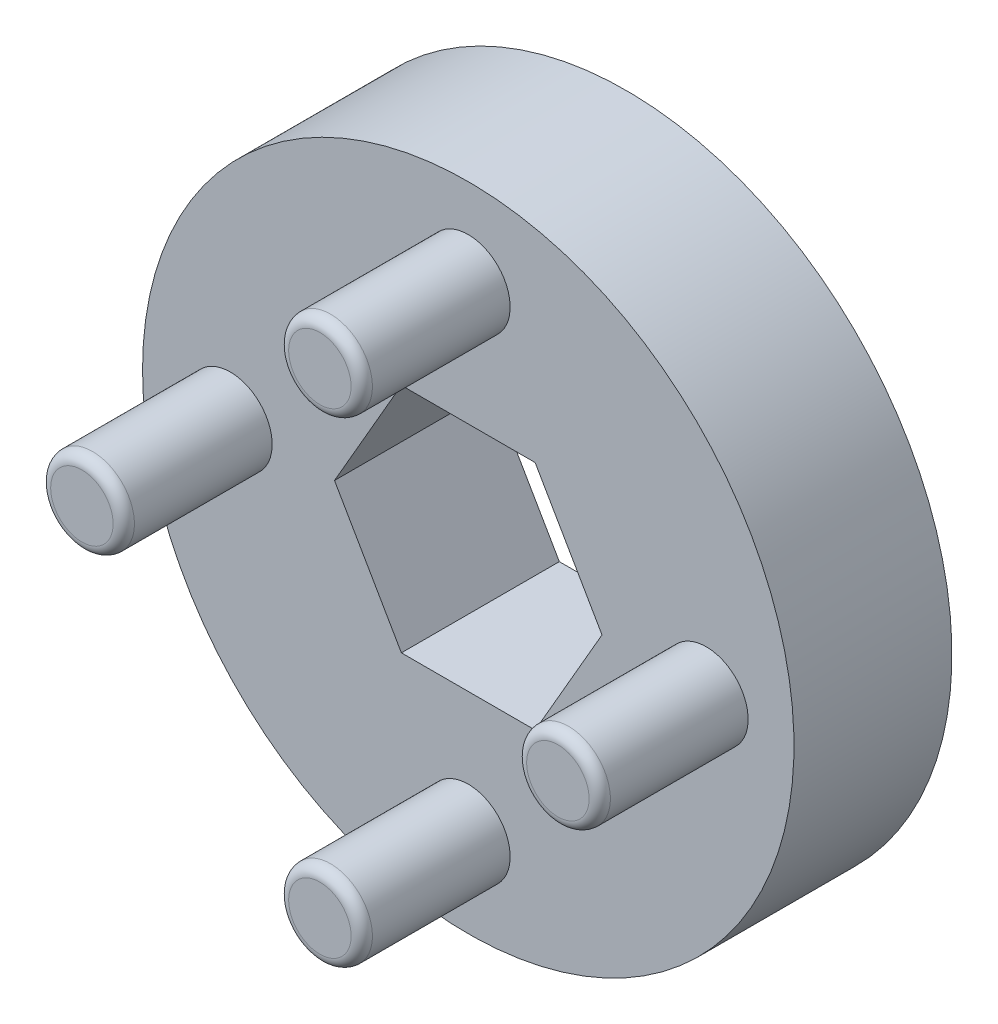
ISO-10303-21;
HEADER;
FILE_DESCRIPTION(('STEP AP214'),'2;1');
FILE_NAME('part.step','',(''),(''),'','','');
FILE_SCHEMA(('AUTOMOTIVE_DESIGN { 1 0 10303 214 1 1 1 1 }'));
ENDSEC;
DATA;
#1=APPLICATION_CONTEXT('core data for automotive mechanical design processes');
#2=APPLICATION_PROTOCOL_DEFINITION('international standard','automotive_design',2000,#1);
#3=PRODUCT_CONTEXT('',#1,'mechanical');
#4=PRODUCT('Part','Part','',(#3));
#5=PRODUCT_RELATED_PRODUCT_CATEGORY('part','',(#4));
#6=PRODUCT_DEFINITION_FORMATION('','',#4);
#7=PRODUCT_DEFINITION_CONTEXT('part definition',#1,'design');
#8=PRODUCT_DEFINITION('design','',#6,#7);
#9=PRODUCT_DEFINITION_SHAPE('','',#8);
#10=(LENGTH_UNIT() NAMED_UNIT(*) SI_UNIT(.MILLI.,.METRE.));
#11=(NAMED_UNIT(*) PLANE_ANGLE_UNIT() SI_UNIT($,.RADIAN.));
#12=(NAMED_UNIT(*) SI_UNIT($,.STERADIAN.) SOLID_ANGLE_UNIT());
#13=UNCERTAINTY_MEASURE_WITH_UNIT(LENGTH_MEASURE(1.E-05),#10,'distance_accuracy_value','');
#14=(GEOMETRIC_REPRESENTATION_CONTEXT(3) GLOBAL_UNCERTAINTY_ASSIGNED_CONTEXT((#13)) GLOBAL_UNIT_ASSIGNED_CONTEXT((#10,
#11,#12)) REPRESENTATION_CONTEXT('',''));
#15=CARTESIAN_POINT('',(0.,0.,0.));
#16=DIRECTION('',(0.,0.,1.));
#17=DIRECTION('',(1.,0.,0.));
#18=AXIS2_PLACEMENT_3D('',#15,#16,#17);
#19=CARTESIAN_POINT('',(-11.3665,1.19057767913881E-13,14.6304));
#20=DIRECTION('',(0.,0.,1.));
#21=DIRECTION('',(1.,0.,0.));
#22=AXIS2_PLACEMENT_3D('',#19,#20,#21);
#23=PLANE('',#22);
#24=CARTESIAN_POINT('',(-11.3665,1.19057767913881E-13,14.6304));
#25=DIRECTION('',(0.,0.,-1.));
#26=DIRECTION('',(-1.,0.,0.));
#27=AXIS2_PLACEMENT_3D('',#24,#25,#26);
#28=CIRCLE('',#27,1.49225);
#29=CARTESIAN_POINT('',(-12.85875,1.19252958243964E-13,14.6304));
#30=VERTEX_POINT('',#29);
#31=CARTESIAN_POINT('',(-9.87425,1.19057767913881E-13,14.6304));
#32=VERTEX_POINT('',#31);
#33=EDGE_CURVE('E92',#30,#32,#28,.T.);
#34=ORIENTED_EDGE('',*,*,#33,.F.);
#35=CARTESIAN_POINT('',(-11.3665,1.19057767913881E-13,14.6304));
#36=DIRECTION('',(0.,0.,-1.));
#37=DIRECTION('',(1.,0.,0.));
#38=AXIS2_PLACEMENT_3D('',#35,#36,#37);
#39=CIRCLE('',#38,1.49225);
#40=EDGE_CURVE('E90',#32,#30,#39,.T.);
#41=ORIENTED_EDGE('',*,*,#40,.F.);
#42=EDGE_LOOP('',(#34,#41));
#43=FACE_BOUND('',#42,.T.);
#44=ADVANCED_FACE('F14',(#43),#23,.T.);
#45=CARTESIAN_POINT('',(0.,-11.3665,14.6304));
#46=DIRECTION('',(0.,0.,1.));
#47=DIRECTION('',(1.,0.,0.));
#48=AXIS2_PLACEMENT_3D('',#45,#46,#47);
#49=PLANE('',#48);
#50=CARTESIAN_POINT('',(0.,-11.3665,14.6304));
#51=DIRECTION('',(0.,0.,-1.));
#52=DIRECTION('',(-1.,0.,0.));
#53=AXIS2_PLACEMENT_3D('',#50,#51,#52);
#54=CIRCLE('',#53,1.49225);
#55=CARTESIAN_POINT('',(-1.49225,-11.3665,14.6304));
#56=VERTEX_POINT('',#55);
#57=CARTESIAN_POINT('',(1.49225,-11.3665,14.6304));
#58=VERTEX_POINT('',#57);
#59=EDGE_CURVE('E327',#56,#58,#54,.T.);
#60=ORIENTED_EDGE('',*,*,#59,.F.);
#61=CARTESIAN_POINT('',(0.,-11.3665,14.6304));
#62=DIRECTION('',(0.,0.,-1.));
#63=DIRECTION('',(1.,0.,0.));
#64=AXIS2_PLACEMENT_3D('',#61,#62,#63);
#65=CIRCLE('',#64,1.49225);
#66=EDGE_CURVE('E98',#58,#56,#65,.T.);
#67=ORIENTED_EDGE('',*,*,#66,.F.);
#68=EDGE_LOOP('',(#60,#67));
#69=FACE_BOUND('',#68,.T.);
#70=ADVANCED_FACE('F331',(#69),#49,.T.);
#71=CARTESIAN_POINT('',(11.3665,0.,14.6304));
#72=DIRECTION('',(0.,0.,1.));
#73=DIRECTION('',(1.,0.,0.));
#74=AXIS2_PLACEMENT_3D('',#71,#72,#73);
#75=PLANE('',#74);
#76=CARTESIAN_POINT('',(11.3665,0.,14.6304));
#77=DIRECTION('',(0.,0.,-1.));
#78=DIRECTION('',(-1.,0.,0.));
#79=AXIS2_PLACEMENT_3D('',#76,#77,#78);
#80=CIRCLE('',#79,1.49225);
#81=CARTESIAN_POINT('',(9.87425,0.,14.6304));
#82=VERTEX_POINT('',#81);
#83=CARTESIAN_POINT('',(12.85875,0.,14.6304));
#84=VERTEX_POINT('',#83);
#85=EDGE_CURVE('E518',#82,#84,#80,.T.);
#86=ORIENTED_EDGE('',*,*,#85,.F.);
#87=CARTESIAN_POINT('',(11.3665,0.,14.6304));
#88=DIRECTION('',(0.,0.,-1.));
#89=DIRECTION('',(1.,0.,0.));
#90=AXIS2_PLACEMENT_3D('',#87,#88,#89);
#91=CIRCLE('',#90,1.49225);
#92=EDGE_CURVE('E308',#84,#82,#91,.T.);
#93=ORIENTED_EDGE('',*,*,#92,.F.);
#94=EDGE_LOOP('',(#86,#93));
#95=FACE_BOUND('',#94,.T.);
#96=ADVANCED_FACE('F168',(#95),#75,.T.);
#97=CARTESIAN_POINT('',(0.,11.3665,14.6304));
#98=DIRECTION('',(0.,0.,1.));
#99=DIRECTION('',(1.,0.,0.));
#100=AXIS2_PLACEMENT_3D('',#97,#98,#99);
#101=PLANE('',#100);
#102=CARTESIAN_POINT('',(0.,11.3665,14.6304));
#103=DIRECTION('',(0.,0.,-1.));
#104=DIRECTION('',(-1.,0.,0.));
#105=AXIS2_PLACEMENT_3D('',#102,#103,#104);
#106=CIRCLE('',#105,1.49225);
#107=CARTESIAN_POINT('',(-1.49225,11.3665,14.6304));
#108=VERTEX_POINT('',#107);
#109=CARTESIAN_POINT('',(1.49225,11.3665,14.6304));
#110=VERTEX_POINT('',#109);
#111=EDGE_CURVE('E148',#108,#110,#106,.T.);
#112=ORIENTED_EDGE('',*,*,#111,.F.);
#113=CARTESIAN_POINT('',(0.,11.3665,14.6304));
#114=DIRECTION('',(0.,0.,-1.));
#115=DIRECTION('',(1.,0.,0.));
#116=AXIS2_PLACEMENT_3D('',#113,#114,#115);
#117=CIRCLE('',#116,1.49225);
#118=EDGE_CURVE('E296',#110,#108,#117,.T.);
#119=ORIENTED_EDGE('',*,*,#118,.F.);
#120=EDGE_LOOP('',(#112,#119));
#121=FACE_BOUND('',#120,.T.);
#122=ADVANCED_FACE('F159',(#121),#101,.T.);
#123=CARTESIAN_POINT('',(-11.3665,1.19057767913881E-13,14.1224));
#124=DIRECTION('',(0.,0.,1.));
#125=DIRECTION('',(1.,0.,0.));
#126=AXIS2_PLACEMENT_3D('',#123,#124,#125);
#127=TOROIDAL_SURFACE('',#126,1.49225,0.508);
#128=ORIENTED_EDGE('',*,*,#40,.T.);
#129=ORIENTED_EDGE('',*,*,#33,.T.);
#130=EDGE_LOOP('',(#128,#129));
#131=FACE_BOUND('',#130,.T.);
#132=CARTESIAN_POINT('',(-11.3665,1.19057767913881E-13,14.1224));
#133=DIRECTION('',(0.,0.,-1.));
#134=DIRECTION('',(-1.,0.,0.));
#135=AXIS2_PLACEMENT_3D('',#132,#133,#134);
#136=CIRCLE('',#135,2.00025);
#137=CARTESIAN_POINT('',(-13.36675,1.19057767913881E-13,14.1224));
#138=VERTEX_POINT('',#137);
#139=EDGE_CURVE('E146',#138,#138,#136,.T.);
#140=ORIENTED_EDGE('',*,*,#139,.F.);
#141=EDGE_LOOP('',(#140));
#142=FACE_BOUND('',#141,.T.);
#143=ADVANCED_FACE('F94',(#131,#142),#127,.T.);
#144=CARTESIAN_POINT('',(0.,-11.3665,14.1224));
#145=DIRECTION('',(0.,0.,1.));
#146=DIRECTION('',(1.,0.,0.));
#147=AXIS2_PLACEMENT_3D('',#144,#145,#146);
#148=TOROIDAL_SURFACE('',#147,1.49225,0.508);
#149=ORIENTED_EDGE('',*,*,#66,.T.);
#150=ORIENTED_EDGE('',*,*,#59,.T.);
#151=EDGE_LOOP('',(#149,#150));
#152=FACE_BOUND('',#151,.T.);
#153=CARTESIAN_POINT('',(0.,-11.3665,14.1224));
#154=DIRECTION('',(0.,0.,-1.));
#155=DIRECTION('',(-1.,0.,0.));
#156=AXIS2_PLACEMENT_3D('',#153,#154,#155);
#157=CIRCLE('',#156,2.00025);
#158=CARTESIAN_POINT('',(-2.00025,-11.3665,14.1224));
#159=VERTEX_POINT('',#158);
#160=EDGE_CURVE('E145',#159,#159,#157,.T.);
#161=ORIENTED_EDGE('',*,*,#160,.F.);
#162=EDGE_LOOP('',(#161));
#163=FACE_BOUND('',#162,.T.);
#164=ADVANCED_FACE('F123',(#152,#163),#148,.T.);
#165=CARTESIAN_POINT('',(11.3665,0.,14.1224));
#166=DIRECTION('',(0.,0.,1.));
#167=DIRECTION('',(1.,0.,0.));
#168=AXIS2_PLACEMENT_3D('',#165,#166,#167);
#169=TOROIDAL_SURFACE('',#168,1.49225,0.508);
#170=ORIENTED_EDGE('',*,*,#92,.T.);
#171=ORIENTED_EDGE('',*,*,#85,.T.);
#172=EDGE_LOOP('',(#170,#171));
#173=FACE_BOUND('',#172,.T.);
#174=CARTESIAN_POINT('',(11.3665,0.,14.1224));
#175=DIRECTION('',(0.,0.,-1.));
#176=DIRECTION('',(-1.,0.,0.));
#177=AXIS2_PLACEMENT_3D('',#174,#175,#176);
#178=CIRCLE('',#177,2.00025);
#179=CARTESIAN_POINT('',(9.36625,0.,14.1224));
#180=VERTEX_POINT('',#179);
#181=EDGE_CURVE('E204',#180,#180,#178,.T.);
#182=ORIENTED_EDGE('',*,*,#181,.F.);
#183=EDGE_LOOP('',(#182));
#184=FACE_BOUND('',#183,.T.);
#185=ADVANCED_FACE('F133',(#173,#184),#169,.T.);
#186=CARTESIAN_POINT('',(0.,11.3665,14.1224));
#187=DIRECTION('',(0.,0.,1.));
#188=DIRECTION('',(1.,0.,0.));
#189=AXIS2_PLACEMENT_3D('',#186,#187,#188);
#190=TOROIDAL_SURFACE('',#189,1.49225,0.508);
#191=ORIENTED_EDGE('',*,*,#118,.T.);
#192=ORIENTED_EDGE('',*,*,#111,.T.);
#193=EDGE_LOOP('',(#191,#192));
#194=FACE_BOUND('',#193,.T.);
#195=CARTESIAN_POINT('',(0.,11.3665,14.1224));
#196=DIRECTION('',(0.,0.,-1.));
#197=DIRECTION('',(-1.,0.,0.));
#198=AXIS2_PLACEMENT_3D('',#195,#196,#197);
#199=CIRCLE('',#198,2.00025);
#200=CARTESIAN_POINT('',(-2.00025,11.3665,14.1224));
#201=VERTEX_POINT('',#200);
#202=EDGE_CURVE('E202',#201,#201,#199,.T.);
#203=ORIENTED_EDGE('',*,*,#202,.F.);
#204=EDGE_LOOP('',(#203));
#205=FACE_BOUND('',#204,.T.);
#206=ADVANCED_FACE('F186',(#194,#205),#190,.T.);
#207=CARTESIAN_POINT('',(-11.3665,1.19057767913881E-13,14.6304));
#208=DIRECTION('',(0.,0.,-1.));
#209=DIRECTION('',(-1.,0.,0.));
#210=AXIS2_PLACEMENT_3D('',#207,#208,#209);
#211=CYLINDRICAL_SURFACE('',#210,2.00025);
#212=CARTESIAN_POINT('',(-11.3665,1.19057767913881E-13,7.5438));
#213=DIRECTION('',(0.,0.,-1.));
#214=DIRECTION('',(-1.,0.,0.));
#215=AXIS2_PLACEMENT_3D('',#212,#213,#214);
#216=CIRCLE('',#215,2.00025);
#217=CARTESIAN_POINT('',(-13.36675,1.19057767913881E-13,7.5438));
#218=VERTEX_POINT('',#217);
#219=EDGE_CURVE('E210',#218,#218,#216,.T.);
#220=ORIENTED_EDGE('',*,*,#219,.F.);
#221=EDGE_LOOP('',(#220));
#222=FACE_BOUND('',#221,.T.);
#223=ORIENTED_EDGE('',*,*,#139,.T.);
#224=EDGE_LOOP('',(#223));
#225=FACE_BOUND('',#224,.T.);
#226=ADVANCED_FACE('F196',(#222,#225),#211,.T.);
#227=CARTESIAN_POINT('',(0.,-11.3665,14.6304));
#228=DIRECTION('',(0.,0.,-1.));
#229=DIRECTION('',(-1.,0.,0.));
#230=AXIS2_PLACEMENT_3D('',#227,#228,#229);
#231=CYLINDRICAL_SURFACE('',#230,2.00025);
#232=CARTESIAN_POINT('',(0.,-11.3665,7.5438));
#233=DIRECTION('',(0.,0.,-1.));
#234=DIRECTION('',(-1.,0.,0.));
#235=AXIS2_PLACEMENT_3D('',#232,#233,#234);
#236=CIRCLE('',#235,2.00025);
#237=CARTESIAN_POINT('',(-2.00025,-11.3665,7.5438));
#238=VERTEX_POINT('',#237);
#239=EDGE_CURVE('E287',#238,#238,#236,.T.);
#240=ORIENTED_EDGE('',*,*,#239,.F.);
#241=EDGE_LOOP('',(#240));
#242=FACE_BOUND('',#241,.T.);
#243=ORIENTED_EDGE('',*,*,#160,.T.);
#244=EDGE_LOOP('',(#243));
#245=FACE_BOUND('',#244,.T.);
#246=ADVANCED_FACE('F214',(#242,#245),#231,.T.);
#247=CARTESIAN_POINT('',(11.3665,0.,14.6304));
#248=DIRECTION('',(0.,0.,-1.));
#249=DIRECTION('',(-1.,0.,0.));
#250=AXIS2_PLACEMENT_3D('',#247,#248,#249);
#251=CYLINDRICAL_SURFACE('',#250,2.00025);
#252=CARTESIAN_POINT('',(11.3665,0.,7.5438));
#253=DIRECTION('',(0.,0.,-1.));
#254=DIRECTION('',(-1.,0.,0.));
#255=AXIS2_PLACEMENT_3D('',#252,#253,#254);
#256=CIRCLE('',#255,2.00025);
#257=CARTESIAN_POINT('',(9.36625,0.,7.5438));
#258=VERTEX_POINT('',#257);
#259=EDGE_CURVE('E281',#258,#258,#256,.T.);
#260=ORIENTED_EDGE('',*,*,#259,.F.);
#261=EDGE_LOOP('',(#260));
#262=FACE_BOUND('',#261,.T.);
#263=ORIENTED_EDGE('',*,*,#181,.T.);
#264=EDGE_LOOP('',(#263));
#265=FACE_BOUND('',#264,.T.);
#266=ADVANCED_FACE('F217',(#262,#265),#251,.T.);
#267=CARTESIAN_POINT('',(0.,11.3665,14.6304));
#268=DIRECTION('',(0.,0.,-1.));
#269=DIRECTION('',(-1.,0.,0.));
#270=AXIS2_PLACEMENT_3D('',#267,#268,#269);
#271=CYLINDRICAL_SURFACE('',#270,2.00025);
#272=CARTESIAN_POINT('',(0.,11.3665,7.5438));
#273=DIRECTION('',(0.,0.,-1.));
#274=DIRECTION('',(-1.,0.,0.));
#275=AXIS2_PLACEMENT_3D('',#272,#273,#274);
#276=CIRCLE('',#275,2.00025);
#277=CARTESIAN_POINT('',(-2.00025,11.3665,7.5438));
#278=VERTEX_POINT('',#277);
#279=EDGE_CURVE('E276',#278,#278,#276,.T.);
#280=ORIENTED_EDGE('',*,*,#279,.F.);
#281=EDGE_LOOP('',(#280));
#282=FACE_BOUND('',#281,.T.);
#283=ORIENTED_EDGE('',*,*,#202,.T.);
#284=EDGE_LOOP('',(#283));
#285=FACE_BOUND('',#284,.T.);
#286=ADVANCED_FACE('F224',(#282,#285),#271,.T.);
#287=CARTESIAN_POINT('',(0.,0.,7.5438));
#288=DIRECTION('',(0.,0.,1.));
#289=DIRECTION('',(1.,0.,0.));
#290=AXIS2_PLACEMENT_3D('',#287,#288,#289);
#291=PLANE('',#290);
#292=DIRECTION('',(0.5,0.866025403784439,0.));
#293=VECTOR('',#292,1.);
#294=CARTESIAN_POINT('',(-3.19405,5.53225688191537,7.5438));
#295=LINE('',#294,#293);
#296=CARTESIAN_POINT('',(-3.19405,5.53225688191537,7.5438));
#297=VERTEX_POINT('',#296);
#298=CARTESIAN_POINT('',(-6.3881,0.,7.5438));
#299=VERTEX_POINT('',#298);
#300=EDGE_CURVE('E578',#297,#299,#295,.F.);
#301=ORIENTED_EDGE('',*,*,#300,.F.);
#302=DIRECTION('',(1.,0.,0.));
#303=VECTOR('',#302,1.);
#304=CARTESIAN_POINT('',(3.19405,5.53225688191537,7.5438));
#305=LINE('',#304,#303);
#306=CARTESIAN_POINT('',(3.19405,5.53225688191537,7.5438));
#307=VERTEX_POINT('',#306);
#308=EDGE_CURVE('E574',#307,#297,#305,.F.);
#309=ORIENTED_EDGE('',*,*,#308,.F.);
#310=DIRECTION('',(0.5,-0.866025403784439,0.));
#311=VECTOR('',#310,1.);
#312=CARTESIAN_POINT('',(6.3881,0.,7.5438));
#313=LINE('',#312,#311);
#314=CARTESIAN_POINT('',(6.3881,0.,7.5438));
#315=VERTEX_POINT('',#314);
#316=EDGE_CURVE('E570',#315,#307,#313,.F.);
#317=ORIENTED_EDGE('',*,*,#316,.F.);
#318=DIRECTION('',(-0.499999999999999,-0.866025403784439,0.));
#319=VECTOR('',#318,1.);
#320=CARTESIAN_POINT('',(3.19405,-5.53225688191537,7.5438));
#321=LINE('',#320,#319);
#322=CARTESIAN_POINT('',(3.19405,-5.53225688191537,7.5438));
#323=VERTEX_POINT('',#322);
#324=EDGE_CURVE('E560',#323,#315,#321,.F.);
#325=ORIENTED_EDGE('',*,*,#324,.F.);
#326=DIRECTION('',(1.,0.,0.));
#327=VECTOR('',#326,1.);
#328=CARTESIAN_POINT('',(-3.19405,-5.53225688191537,7.5438));
#329=LINE('',#328,#327);
#330=CARTESIAN_POINT('',(-3.19405,-5.53225688191537,7.5438));
#331=VERTEX_POINT('',#330);
#332=EDGE_CURVE('E284',#331,#323,#329,.T.);
#333=ORIENTED_EDGE('',*,*,#332,.F.);
#334=DIRECTION('',(-0.5,0.866025403784438,0.));
#335=VECTOR('',#334,1.);
#336=CARTESIAN_POINT('',(-6.3881,0.,7.5438));
#337=LINE('',#336,#335);
#338=EDGE_CURVE('E582',#299,#331,#337,.F.);
#339=ORIENTED_EDGE('',*,*,#338,.F.);
#340=EDGE_LOOP('',(#301,#309,#317,#325,#333,#339));
#341=FACE_BOUND('',#340,.T.);
#342=CARTESIAN_POINT('',(0.,0.,7.5438));
#343=DIRECTION('',(0.,0.,-1.));
#344=DIRECTION('',(-1.,0.,0.));
#345=AXIS2_PLACEMENT_3D('',#342,#343,#344);
#346=CIRCLE('',#345,15.5575);
#347=CARTESIAN_POINT('',(-15.5575,0.,7.5438));
#348=VERTEX_POINT('',#347);
#349=EDGE_CURVE('E280',#348,#348,#346,.T.);
#350=ORIENTED_EDGE('',*,*,#349,.F.);
#351=EDGE_LOOP('',(#350));
#352=FACE_BOUND('',#351,.T.);
#353=ORIENTED_EDGE('',*,*,#279,.T.);
#354=EDGE_LOOP('',(#353));
#355=FACE_BOUND('',#354,.T.);
#356=ORIENTED_EDGE('',*,*,#259,.T.);
#357=EDGE_LOOP('',(#356));
#358=FACE_BOUND('',#357,.T.);
#359=ORIENTED_EDGE('',*,*,#239,.T.);
#360=EDGE_LOOP('',(#359));
#361=FACE_BOUND('',#360,.T.);
#362=ORIENTED_EDGE('',*,*,#219,.T.);
#363=EDGE_LOOP('',(#362));
#364=FACE_BOUND('',#363,.T.);
#365=ADVANCED_FACE('F264',(#341,#352,#355,#358,#361,#364),#291,.T.);
#366=CARTESIAN_POINT('',(0.,0.,7.5438));
#367=DIRECTION('',(0.,0.,-1.));
#368=DIRECTION('',(-1.,0.,0.));
#369=AXIS2_PLACEMENT_3D('',#366,#367,#368);
#370=CYLINDRICAL_SURFACE('',#369,15.5575);
#371=ORIENTED_EDGE('',*,*,#349,.T.);
#372=EDGE_LOOP('',(#371));
#373=FACE_BOUND('',#372,.T.);
#374=CARTESIAN_POINT('',(0.,0.,0.));
#375=DIRECTION('',(0.,0.,-1.));
#376=DIRECTION('',(-1.,0.,0.));
#377=AXIS2_PLACEMENT_3D('',#374,#375,#376);
#378=CIRCLE('',#377,15.5575);
#379=CARTESIAN_POINT('',(-15.5575,0.,0.));
#380=VERTEX_POINT('',#379);
#381=EDGE_CURVE('E545',#380,#380,#378,.F.);
#382=ORIENTED_EDGE('',*,*,#381,.T.);
#383=EDGE_LOOP('',(#382));
#384=FACE_BOUND('',#383,.T.);
#385=ADVANCED_FACE('F260',(#373,#384),#370,.T.);
#386=CARTESIAN_POINT('',(-3.19405,-5.53225688191537,7.5438));
#387=DIRECTION('',(0.,1.,0.));
#388=DIRECTION('',(0.,0.,1.));
#389=AXIS2_PLACEMENT_3D('',#386,#387,#388);
#390=PLANE('',#389);
#391=ORIENTED_EDGE('',*,*,#332,.T.);
#392=DIRECTION('',(0.,0.,1.));
#393=VECTOR('',#392,1.);
#394=CARTESIAN_POINT('',(3.19405,-5.53225688191537,7.5438));
#395=LINE('',#394,#393);
#396=CARTESIAN_POINT('',(3.19405,-5.53225688191537,0.));
#397=VERTEX_POINT('',#396);
#398=EDGE_CURVE('E562',#397,#323,#395,.T.);
#399=ORIENTED_EDGE('',*,*,#398,.F.);
#400=DIRECTION('',(1.,0.,0.));
#401=VECTOR('',#400,1.);
#402=CARTESIAN_POINT('',(0.,-5.53225688191537,0.));
#403=LINE('',#402,#401);
#404=CARTESIAN_POINT('',(-3.19405,-5.53225688191537,0.));
#405=VERTEX_POINT('',#404);
#406=EDGE_CURVE('E547',#397,#405,#403,.F.);
#407=ORIENTED_EDGE('',*,*,#406,.T.);
#408=DIRECTION('',(0.,0.,1.));
#409=VECTOR('',#408,1.);
#410=CARTESIAN_POINT('',(-3.19404999999999,-5.53225688191537,7.5438));
#411=LINE('',#410,#409);
#412=EDGE_CURVE('E580',#331,#405,#411,.F.);
#413=ORIENTED_EDGE('',*,*,#412,.F.);
#414=EDGE_LOOP('',(#391,#399,#407,#413));
#415=FACE_BOUND('',#414,.T.);
#416=ADVANCED_FACE('F256',(#415),#390,.T.);
#417=CARTESIAN_POINT('',(-6.3881,0.,7.5438));
#418=DIRECTION('',(0.866025403784438,0.5,0.));
#419=DIRECTION('',(-0.5,0.866025403784438,0.));
#420=AXIS2_PLACEMENT_3D('',#417,#418,#419);
#421=PLANE('',#420);
#422=ORIENTED_EDGE('',*,*,#338,.T.);
#423=ORIENTED_EDGE('',*,*,#412,.T.);
#424=DIRECTION('',(-0.5,0.866025403784438,0.));
#425=VECTOR('',#424,1.);
#426=CARTESIAN_POINT('',(-3.19405,-5.53225688191537,0.));
#427=LINE('',#426,#425);
#428=CARTESIAN_POINT('',(-6.3881,0.,0.));
#429=VERTEX_POINT('',#428);
#430=EDGE_CURVE('E558',#405,#429,#427,.T.);
#431=ORIENTED_EDGE('',*,*,#430,.T.);
#432=DIRECTION('',(0.,0.,1.));
#433=VECTOR('',#432,1.);
#434=CARTESIAN_POINT('',(-6.3881,0.,7.5438));
#435=LINE('',#434,#433);
#436=EDGE_CURVE('E576',#299,#429,#435,.F.);
#437=ORIENTED_EDGE('',*,*,#436,.F.);
#438=EDGE_LOOP('',(#422,#423,#431,#437));
#439=FACE_BOUND('',#438,.T.);
#440=ADVANCED_FACE('F252',(#439),#421,.T.);
#441=CARTESIAN_POINT('',(-3.19405,5.53225688191537,7.5438));
#442=DIRECTION('',(0.866025403784439,-0.5,0.));
#443=DIRECTION('',(0.5,0.866025403784439,0.));
#444=AXIS2_PLACEMENT_3D('',#441,#442,#443);
#445=PLANE('',#444);
#446=ORIENTED_EDGE('',*,*,#300,.T.);
#447=ORIENTED_EDGE('',*,*,#436,.T.);
#448=DIRECTION('',(0.5,0.866025403784439,0.));
#449=VECTOR('',#448,1.);
#450=CARTESIAN_POINT('',(-6.3881,0.,0.));
#451=LINE('',#450,#449);
#452=CARTESIAN_POINT('',(-3.19405,5.53225688191537,0.));
#453=VERTEX_POINT('',#452);
#454=EDGE_CURVE('E598',#429,#453,#451,.T.);
#455=ORIENTED_EDGE('',*,*,#454,.T.);
#456=DIRECTION('',(0.,0.,1.));
#457=VECTOR('',#456,1.);
#458=CARTESIAN_POINT('',(-3.19405,5.53225688191537,7.5438));
#459=LINE('',#458,#457);
#460=EDGE_CURVE('E572',#297,#453,#459,.F.);
#461=ORIENTED_EDGE('',*,*,#460,.F.);
#462=EDGE_LOOP('',(#446,#447,#455,#461));
#463=FACE_BOUND('',#462,.T.);
#464=ADVANCED_FACE('F248',(#463),#445,.T.);
#465=CARTESIAN_POINT('',(3.19405,5.53225688191537,7.5438));
#466=DIRECTION('',(0.,-1.,0.));
#467=DIRECTION('',(1.,0.,0.));
#468=AXIS2_PLACEMENT_3D('',#465,#466,#467);
#469=PLANE('',#468);
#470=ORIENTED_EDGE('',*,*,#308,.T.);
#471=ORIENTED_EDGE('',*,*,#460,.T.);
#472=DIRECTION('',(1.,0.,0.));
#473=VECTOR('',#472,1.);
#474=CARTESIAN_POINT('',(0.,5.53225688191537,0.));
#475=LINE('',#474,#473);
#476=CARTESIAN_POINT('',(3.19405,5.53225688191537,0.));
#477=VERTEX_POINT('',#476);
#478=EDGE_CURVE('E596',#453,#477,#475,.T.);
#479=ORIENTED_EDGE('',*,*,#478,.T.);
#480=DIRECTION('',(0.,0.,1.));
#481=VECTOR('',#480,1.);
#482=CARTESIAN_POINT('',(3.19405,5.53225688191537,7.5438));
#483=LINE('',#482,#481);
#484=EDGE_CURVE('E568',#307,#477,#483,.F.);
#485=ORIENTED_EDGE('',*,*,#484,.F.);
#486=EDGE_LOOP('',(#470,#471,#479,#485));
#487=FACE_BOUND('',#486,.T.);
#488=ADVANCED_FACE('F244',(#487),#469,.T.);
#489=CARTESIAN_POINT('',(6.3881,0.,7.5438));
#490=DIRECTION('',(-0.866025403784439,-0.5,0.));
#491=DIRECTION('',(0.5,-0.866025403784439,0.));
#492=AXIS2_PLACEMENT_3D('',#489,#490,#491);
#493=PLANE('',#492);
#494=ORIENTED_EDGE('',*,*,#316,.T.);
#495=ORIENTED_EDGE('',*,*,#484,.T.);
#496=DIRECTION('',(0.5,-0.866025403784439,0.));
#497=VECTOR('',#496,1.);
#498=CARTESIAN_POINT('',(3.19405,5.53225688191537,0.));
#499=LINE('',#498,#497);
#500=CARTESIAN_POINT('',(6.3881,0.,0.));
#501=VERTEX_POINT('',#500);
#502=EDGE_CURVE('E26',#477,#501,#499,.T.);
#503=ORIENTED_EDGE('',*,*,#502,.T.);
#504=DIRECTION('',(0.,0.,1.));
#505=VECTOR('',#504,1.);
#506=CARTESIAN_POINT('',(6.3881,0.,7.5438));
#507=LINE('',#506,#505);
#508=EDGE_CURVE('E34',#315,#501,#507,.F.);
#509=ORIENTED_EDGE('',*,*,#508,.F.);
#510=EDGE_LOOP('',(#494,#495,#503,#509));
#511=FACE_BOUND('',#510,.T.);
#512=ADVANCED_FACE('F237',(#511),#493,.T.);
#513=CARTESIAN_POINT('',(3.19405,-5.53225688191537,7.5438));
#514=DIRECTION('',(-0.866025403784439,0.499999999999999,0.));
#515=DIRECTION('',(-0.499999999999999,-0.866025403784439,0.));
#516=AXIS2_PLACEMENT_3D('',#513,#514,#515);
#517=PLANE('',#516);
#518=ORIENTED_EDGE('',*,*,#324,.T.);
#519=ORIENTED_EDGE('',*,*,#508,.T.);
#520=DIRECTION('',(-0.499999999999999,-0.866025403784439,0.));
#521=VECTOR('',#520,1.);
#522=CARTESIAN_POINT('',(6.3881,0.,0.));
#523=LINE('',#522,#521);
#524=EDGE_CURVE('E9',#501,#397,#523,.T.);
#525=ORIENTED_EDGE('',*,*,#524,.T.);
#526=ORIENTED_EDGE('',*,*,#398,.T.);
#527=EDGE_LOOP('',(#518,#519,#525,#526));
#528=FACE_BOUND('',#527,.T.);
#529=ADVANCED_FACE('F231',(#528),#517,.T.);
#530=CARTESIAN_POINT('',(0.,0.,0.));
#531=DIRECTION('',(0.,0.,1.));
#532=DIRECTION('',(1.,0.,0.));
#533=AXIS2_PLACEMENT_3D('',#530,#531,#532);
#534=PLANE('',#533);
#535=ORIENTED_EDGE('',*,*,#502,.F.);
#536=ORIENTED_EDGE('',*,*,#478,.F.);
#537=ORIENTED_EDGE('',*,*,#454,.F.);
#538=ORIENTED_EDGE('',*,*,#430,.F.);
#539=ORIENTED_EDGE('',*,*,#406,.F.);
#540=ORIENTED_EDGE('',*,*,#524,.F.);
#541=EDGE_LOOP('',(#535,#536,#537,#538,#539,#540));
#542=FACE_BOUND('',#541,.T.);
#543=ORIENTED_EDGE('',*,*,#381,.F.);
#544=EDGE_LOOP('',(#543));
#545=FACE_BOUND('',#544,.T.);
#546=ADVANCED_FACE('F229',(#542,#545),#534,.F.);
#547=CLOSED_SHELL('',(#44,#70,#96,#122,#143,#164,#185,#206,#226,#246,#266,#286,#365,#385,#416,
#440,#464,#488,#512,#529,#546));
#548=MANIFOLD_SOLID_BREP('B1',#547);
#549=ADVANCED_BREP_SHAPE_REPRESENTATION('',(#18,#548),#14);
#550=SHAPE_DEFINITION_REPRESENTATION(#9,#549);
ENDSEC;
END-ISO-10303-21;
